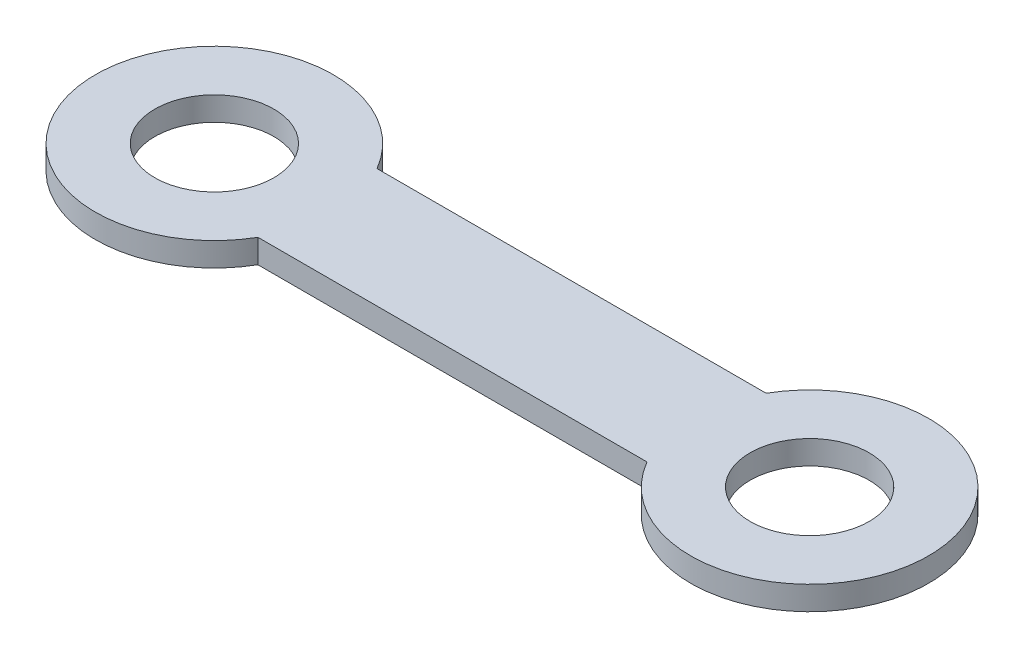
ISO-10303-21;
HEADER;
FILE_DESCRIPTION(('STEP AP214'),'2;1');
FILE_NAME('part.step','',(''),(''),'','','');
FILE_SCHEMA(('AUTOMOTIVE_DESIGN { 1 0 10303 214 1 1 1 1 }'));
ENDSEC;
DATA;
#1=APPLICATION_CONTEXT('core data for automotive mechanical design processes');
#2=APPLICATION_PROTOCOL_DEFINITION('international standard','automotive_design',2000,#1);
#3=PRODUCT_CONTEXT('',#1,'mechanical');
#4=PRODUCT('Part','Part','',(#3));
#5=PRODUCT_RELATED_PRODUCT_CATEGORY('part','',(#4));
#6=PRODUCT_DEFINITION_FORMATION('','',#4);
#7=PRODUCT_DEFINITION_CONTEXT('part definition',#1,'design');
#8=PRODUCT_DEFINITION('design','',#6,#7);
#9=PRODUCT_DEFINITION_SHAPE('','',#8);
#10=(LENGTH_UNIT() NAMED_UNIT(*) SI_UNIT(.MILLI.,.METRE.));
#11=(NAMED_UNIT(*) PLANE_ANGLE_UNIT() SI_UNIT($,.RADIAN.));
#12=(NAMED_UNIT(*) SI_UNIT($,.STERADIAN.) SOLID_ANGLE_UNIT());
#13=UNCERTAINTY_MEASURE_WITH_UNIT(LENGTH_MEASURE(1.E-05),#10,'distance_accuracy_value','');
#14=(GEOMETRIC_REPRESENTATION_CONTEXT(3) GLOBAL_UNCERTAINTY_ASSIGNED_CONTEXT((#13)) GLOBAL_UNIT_ASSIGNED_CONTEXT((#10,
#11,#12)) REPRESENTATION_CONTEXT('',''));
#15=CARTESIAN_POINT('',(0.,0.,0.));
#16=DIRECTION('',(0.,0.,1.));
#17=DIRECTION('',(1.,0.,0.));
#18=AXIS2_PLACEMENT_3D('',#15,#16,#17);
#19=CARTESIAN_POINT('',(50.,2.,0.));
#20=DIRECTION('',(0.,1.,0.));
#21=DIRECTION('',(0.,0.,1.));
#22=AXIS2_PLACEMENT_3D('',#19,#20,#21);
#23=PLANE('',#22);
#24=CARTESIAN_POINT('',(0.,2.,0.));
#25=DIRECTION('',(0.,1.,0.));
#26=DIRECTION('',(0.,0.,1.));
#27=AXIS2_PLACEMENT_3D('',#24,#25,#26);
#28=CIRCLE('',#27,5.);
#29=CARTESIAN_POINT('',(0.,2.,5.));
#30=VERTEX_POINT('',#29);
#31=EDGE_CURVE('E112',#30,#30,#28,.T.);
#32=ORIENTED_EDGE('',*,*,#31,.F.);
#33=EDGE_LOOP('',(#32));
#34=FACE_BOUND('',#33,.T.);
#35=CARTESIAN_POINT('',(50.,2.,0.));
#36=DIRECTION('',(0.,1.,0.));
#37=DIRECTION('',(0.,0.,1.));
#38=AXIS2_PLACEMENT_3D('',#35,#36,#37);
#39=CIRCLE('',#38,9.99999999999999);
#40=CARTESIAN_POINT('',(41.3397459621556,2.,4.99999999999999));
#41=VERTEX_POINT('',#40);
#42=CARTESIAN_POINT('',(41.3397459621556,2.,-4.99999999999999));
#43=VERTEX_POINT('',#42);
#44=EDGE_CURVE('E92',#41,#43,#39,.T.);
#45=ORIENTED_EDGE('',*,*,#44,.T.);
#46=DIRECTION('',(-1.,0.,0.));
#47=VECTOR('',#46,1.);
#48=CARTESIAN_POINT('',(41.3397459621556,2.,-4.99999999999999));
#49=LINE('',#48,#47);
#50=CARTESIAN_POINT('',(8.6602540378444,2.,-4.99999999999998));
#51=VERTEX_POINT('',#50);
#52=EDGE_CURVE('E87',#43,#51,#49,.T.);
#53=ORIENTED_EDGE('',*,*,#52,.T.);
#54=CARTESIAN_POINT('',(0.,2.,0.));
#55=DIRECTION('',(0.,1.,0.));
#56=DIRECTION('',(0.,0.,1.));
#57=AXIS2_PLACEMENT_3D('',#54,#55,#56);
#58=CIRCLE('',#57,10.);
#59=CARTESIAN_POINT('',(8.6602540378444,2.,4.99999999999998));
#60=VERTEX_POINT('',#59);
#61=EDGE_CURVE('E90',#51,#60,#58,.T.);
#62=ORIENTED_EDGE('',*,*,#61,.T.);
#63=DIRECTION('',(1.,0.,0.));
#64=VECTOR('',#63,1.);
#65=CARTESIAN_POINT('',(8.6602540378444,2.,4.99999999999998));
#66=LINE('',#65,#64);
#67=EDGE_CURVE('E57',#60,#41,#66,.T.);
#68=ORIENTED_EDGE('',*,*,#67,.T.);
#69=EDGE_LOOP('',(#45,#53,#62,#68));
#70=FACE_BOUND('',#69,.T.);
#71=CARTESIAN_POINT('',(50.,2.,0.));
#72=DIRECTION('',(0.,1.,0.));
#73=DIRECTION('',(0.,0.,1.));
#74=AXIS2_PLACEMENT_3D('',#71,#72,#73);
#75=CIRCLE('',#74,4.99999999999999);
#76=CARTESIAN_POINT('',(50.,2.,4.99999999999999));
#77=VERTEX_POINT('',#76);
#78=EDGE_CURVE('E134',#77,#77,#75,.T.);
#79=ORIENTED_EDGE('',*,*,#78,.F.);
#80=EDGE_LOOP('',(#79));
#81=FACE_BOUND('',#80,.T.);
#82=ADVANCED_FACE('F39',(#34,#70,#81),#23,.T.);
#83=CARTESIAN_POINT('',(50.,0.,0.));
#84=DIRECTION('',(0.,1.,0.));
#85=DIRECTION('',(0.,0.,1.));
#86=AXIS2_PLACEMENT_3D('',#83,#84,#85);
#87=PLANE('',#86);
#88=CARTESIAN_POINT('',(50.,0.,0.));
#89=DIRECTION('',(0.,1.,0.));
#90=DIRECTION('',(0.,0.,1.));
#91=AXIS2_PLACEMENT_3D('',#88,#89,#90);
#92=CIRCLE('',#91,9.99999999999999);
#93=CARTESIAN_POINT('',(41.3397459621556,0.,4.99999999999999));
#94=VERTEX_POINT('',#93);
#95=CARTESIAN_POINT('',(41.3397459621556,0.,-4.99999999999999));
#96=VERTEX_POINT('',#95);
#97=EDGE_CURVE('E108',#94,#96,#92,.T.);
#98=ORIENTED_EDGE('',*,*,#97,.F.);
#99=DIRECTION('',(1.,0.,0.));
#100=VECTOR('',#99,1.);
#101=CARTESIAN_POINT('',(8.6602540378444,0.,4.99999999999998));
#102=LINE('',#101,#100);
#103=CARTESIAN_POINT('',(8.6602540378444,0.,4.99999999999998));
#104=VERTEX_POINT('',#103);
#105=EDGE_CURVE('E80',#104,#94,#102,.T.);
#106=ORIENTED_EDGE('',*,*,#105,.F.);
#107=CARTESIAN_POINT('',(0.,0.,0.));
#108=DIRECTION('',(0.,1.,0.));
#109=DIRECTION('',(0.,0.,1.));
#110=AXIS2_PLACEMENT_3D('',#107,#108,#109);
#111=CIRCLE('',#110,10.);
#112=CARTESIAN_POINT('',(8.6602540378444,0.,-4.99999999999998));
#113=VERTEX_POINT('',#112);
#114=EDGE_CURVE('E74',#113,#104,#111,.T.);
#115=ORIENTED_EDGE('',*,*,#114,.F.);
#116=DIRECTION('',(-1.,0.,0.));
#117=VECTOR('',#116,1.);
#118=CARTESIAN_POINT('',(41.3397459621556,0.,-4.99999999999999));
#119=LINE('',#118,#117);
#120=EDGE_CURVE('E97',#96,#113,#119,.T.);
#121=ORIENTED_EDGE('',*,*,#120,.F.);
#122=EDGE_LOOP('',(#98,#106,#115,#121));
#123=FACE_BOUND('',#122,.T.);
#124=CARTESIAN_POINT('',(0.,0.,0.));
#125=DIRECTION('',(0.,1.,0.));
#126=DIRECTION('',(0.,0.,1.));
#127=AXIS2_PLACEMENT_3D('',#124,#125,#126);
#128=CIRCLE('',#127,5.);
#129=CARTESIAN_POINT('',(0.,0.,5.));
#130=VERTEX_POINT('',#129);
#131=EDGE_CURVE('E130',#130,#130,#128,.T.);
#132=ORIENTED_EDGE('',*,*,#131,.T.);
#133=EDGE_LOOP('',(#132));
#134=FACE_BOUND('',#133,.T.);
#135=CARTESIAN_POINT('',(50.,0.,0.));
#136=DIRECTION('',(0.,1.,0.));
#137=DIRECTION('',(0.,0.,1.));
#138=AXIS2_PLACEMENT_3D('',#135,#136,#137);
#139=CIRCLE('',#138,4.99999999999999);
#140=CARTESIAN_POINT('',(50.,0.,4.99999999999999));
#141=VERTEX_POINT('',#140);
#142=EDGE_CURVE('E138',#141,#141,#139,.T.);
#143=ORIENTED_EDGE('',*,*,#142,.T.);
#144=EDGE_LOOP('',(#143));
#145=FACE_BOUND('',#144,.T.);
#146=ADVANCED_FACE('F125',(#123,#134,#145),#87,.F.);
#147=CARTESIAN_POINT('',(50.,2.,0.));
#148=DIRECTION('',(0.,-1.,0.));
#149=DIRECTION('',(0.,0.,-1.));
#150=AXIS2_PLACEMENT_3D('',#147,#148,#149);
#151=CYLINDRICAL_SURFACE('',#150,9.99999999999999);
#152=ORIENTED_EDGE('',*,*,#97,.T.);
#153=DIRECTION('',(0.,-1.,0.));
#154=VECTOR('',#153,1.);
#155=CARTESIAN_POINT('',(41.3397459621556,2.,-4.99999999999999));
#156=LINE('',#155,#154);
#157=EDGE_CURVE('E11',#43,#96,#156,.T.);
#158=ORIENTED_EDGE('',*,*,#157,.F.);
#159=ORIENTED_EDGE('',*,*,#44,.F.);
#160=DIRECTION('',(0.,-1.,0.));
#161=VECTOR('',#160,1.);
#162=CARTESIAN_POINT('',(41.3397459621556,2.,4.99999999999999));
#163=LINE('',#162,#161);
#164=EDGE_CURVE('E104',#41,#94,#163,.T.);
#165=ORIENTED_EDGE('',*,*,#164,.T.);
#166=EDGE_LOOP('',(#152,#158,#159,#165));
#167=FACE_BOUND('',#166,.T.);
#168=ADVANCED_FACE('F41',(#167),#151,.T.);
#169=CARTESIAN_POINT('',(41.3397459621556,2.,-4.99999999999999));
#170=DIRECTION('',(0.,0.,1.));
#171=DIRECTION('',(1.,0.,0.));
#172=AXIS2_PLACEMENT_3D('',#169,#170,#171);
#173=PLANE('',#172);
#174=ORIENTED_EDGE('',*,*,#120,.T.);
#175=DIRECTION('',(0.,-1.,0.));
#176=VECTOR('',#175,1.);
#177=CARTESIAN_POINT('',(8.6602540378444,2.,-4.99999999999998));
#178=LINE('',#177,#176);
#179=EDGE_CURVE('E49',#51,#113,#178,.T.);
#180=ORIENTED_EDGE('',*,*,#179,.F.);
#181=ORIENTED_EDGE('',*,*,#52,.F.);
#182=ORIENTED_EDGE('',*,*,#157,.T.);
#183=EDGE_LOOP('',(#174,#180,#181,#182));
#184=FACE_BOUND('',#183,.T.);
#185=ADVANCED_FACE('F96',(#184),#173,.F.);
#186=CARTESIAN_POINT('',(0.,2.,0.));
#187=DIRECTION('',(0.,-1.,0.));
#188=DIRECTION('',(0.,0.,-1.));
#189=AXIS2_PLACEMENT_3D('',#186,#187,#188);
#190=CYLINDRICAL_SURFACE('',#189,10.);
#191=ORIENTED_EDGE('',*,*,#114,.T.);
#192=DIRECTION('',(0.,-1.,0.));
#193=VECTOR('',#192,1.);
#194=CARTESIAN_POINT('',(8.6602540378444,2.,4.99999999999998));
#195=LINE('',#194,#193);
#196=EDGE_CURVE('E99',#60,#104,#195,.T.);
#197=ORIENTED_EDGE('',*,*,#196,.F.);
#198=ORIENTED_EDGE('',*,*,#61,.F.);
#199=ORIENTED_EDGE('',*,*,#179,.T.);
#200=EDGE_LOOP('',(#191,#197,#198,#199));
#201=FACE_BOUND('',#200,.T.);
#202=ADVANCED_FACE('F100',(#201),#190,.T.);
#203=CARTESIAN_POINT('',(8.6602540378444,2.,4.99999999999998));
#204=DIRECTION('',(0.,0.,-1.));
#205=DIRECTION('',(-1.,0.,0.));
#206=AXIS2_PLACEMENT_3D('',#203,#204,#205);
#207=PLANE('',#206);
#208=ORIENTED_EDGE('',*,*,#105,.T.);
#209=ORIENTED_EDGE('',*,*,#164,.F.);
#210=ORIENTED_EDGE('',*,*,#67,.F.);
#211=ORIENTED_EDGE('',*,*,#196,.T.);
#212=EDGE_LOOP('',(#208,#209,#210,#211));
#213=FACE_BOUND('',#212,.T.);
#214=ADVANCED_FACE('F122',(#213),#207,.F.);
#215=CARTESIAN_POINT('',(0.,2.,0.));
#216=DIRECTION('',(0.,-1.,0.));
#217=DIRECTION('',(0.,0.,-1.));
#218=AXIS2_PLACEMENT_3D('',#215,#216,#217);
#219=CYLINDRICAL_SURFACE('',#218,5.);
#220=ORIENTED_EDGE('',*,*,#31,.T.);
#221=EDGE_LOOP('',(#220));
#222=FACE_BOUND('',#221,.T.);
#223=ORIENTED_EDGE('',*,*,#131,.F.);
#224=EDGE_LOOP('',(#223));
#225=FACE_BOUND('',#224,.T.);
#226=ADVANCED_FACE('F157',(#222,#225),#219,.F.);
#227=CARTESIAN_POINT('',(50.,2.,0.));
#228=DIRECTION('',(0.,-1.,0.));
#229=DIRECTION('',(0.,0.,-1.));
#230=AXIS2_PLACEMENT_3D('',#227,#228,#229);
#231=CYLINDRICAL_SURFACE('',#230,4.99999999999999);
#232=ORIENTED_EDGE('',*,*,#78,.T.);
#233=EDGE_LOOP('',(#232));
#234=FACE_BOUND('',#233,.T.);
#235=ORIENTED_EDGE('',*,*,#142,.F.);
#236=EDGE_LOOP('',(#235));
#237=FACE_BOUND('',#236,.T.);
#238=ADVANCED_FACE('F146',(#234,#237),#231,.F.);
#239=CLOSED_SHELL('',(#82,#146,#168,#185,#202,#214,#226,#238));
#240=MANIFOLD_SOLID_BREP('B2',#239);
#241=ADVANCED_BREP_SHAPE_REPRESENTATION('',(#18,#240),#14);
#242=SHAPE_DEFINITION_REPRESENTATION(#9,#241);
ENDSEC;
END-ISO-10303-21;
